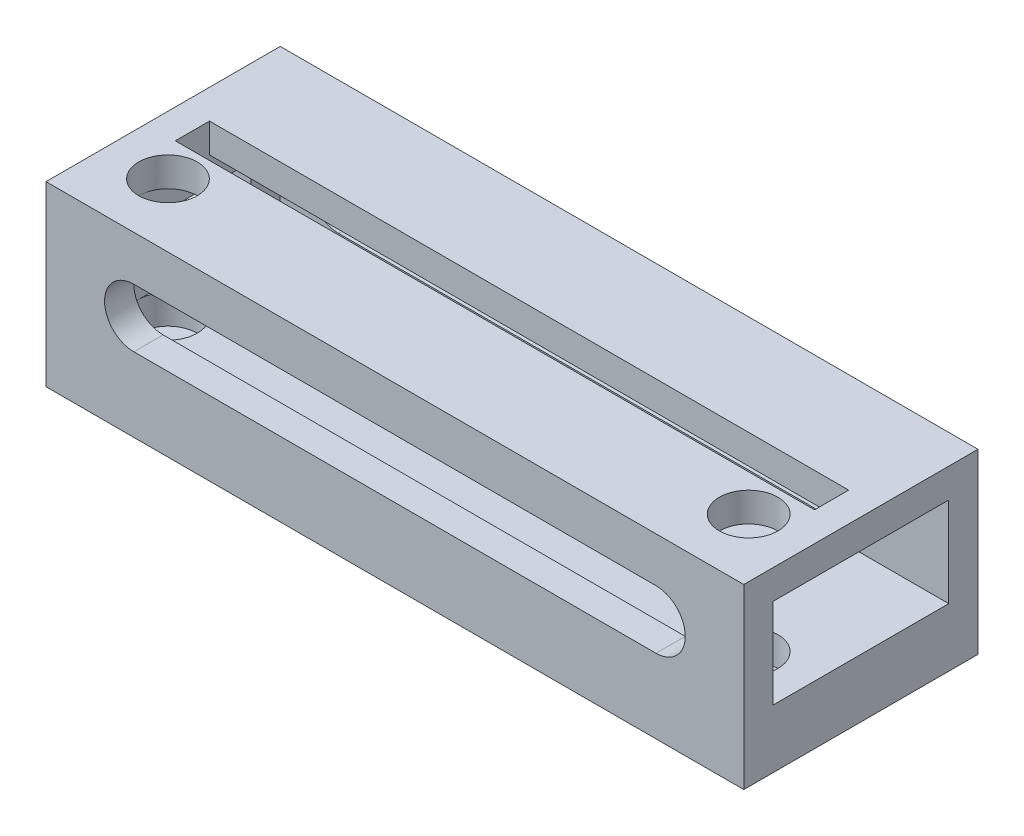
ISO-10303-21;
HEADER;
FILE_DESCRIPTION(('STEP AP214'),'2;1');
FILE_NAME('part.step','',(''),(''),'','','');
FILE_SCHEMA(('AUTOMOTIVE_DESIGN { 1 0 10303 214 1 1 1 1 }'));
ENDSEC;
DATA;
#1=APPLICATION_CONTEXT('core data for automotive mechanical design processes');
#2=APPLICATION_PROTOCOL_DEFINITION('international standard','automotive_design',2000,#1);
#3=PRODUCT_CONTEXT('',#1,'mechanical');
#4=PRODUCT('Part','Part','',(#3));
#5=PRODUCT_RELATED_PRODUCT_CATEGORY('part','',(#4));
#6=PRODUCT_DEFINITION_FORMATION('','',#4);
#7=PRODUCT_DEFINITION_CONTEXT('part definition',#1,'design');
#8=PRODUCT_DEFINITION('design','',#6,#7);
#9=PRODUCT_DEFINITION_SHAPE('','',#8);
#10=(LENGTH_UNIT() NAMED_UNIT(*) SI_UNIT(.MILLI.,.METRE.));
#11=(NAMED_UNIT(*) PLANE_ANGLE_UNIT() SI_UNIT($,.RADIAN.));
#12=(NAMED_UNIT(*) SI_UNIT($,.STERADIAN.) SOLID_ANGLE_UNIT());
#13=UNCERTAINTY_MEASURE_WITH_UNIT(LENGTH_MEASURE(1.E-05),#10,'distance_accuracy_value','');
#14=(GEOMETRIC_REPRESENTATION_CONTEXT(3) GLOBAL_UNCERTAINTY_ASSIGNED_CONTEXT((#13)) GLOBAL_UNIT_ASSIGNED_CONTEXT((#10,
#11,#12)) REPRESENTATION_CONTEXT('',''));
#15=CARTESIAN_POINT('',(0.,0.,0.));
#16=DIRECTION('',(0.,0.,1.));
#17=DIRECTION('',(1.,0.,0.));
#18=AXIS2_PLACEMENT_3D('',#15,#16,#17);
#19=CARTESIAN_POINT('',(0.,0.,0.));
#20=DIRECTION('',(0.,-1.,0.));
#21=DIRECTION('',(0.,0.,-1.));
#22=AXIS2_PLACEMENT_3D('',#19,#20,#21);
#23=PLANE('',#22);
#24=DIRECTION('',(0.,0.,-1.));
#25=VECTOR('',#24,1.);
#26=CARTESIAN_POINT('',(35.75,0.,-17.5));
#27=LINE('',#26,#25);
#28=CARTESIAN_POINT('',(35.75,0.,6.5));
#29=VERTEX_POINT('',#28);
#30=CARTESIAN_POINT('',(35.75,0.,-17.5));
#31=VERTEX_POINT('',#30);
#32=EDGE_CURVE('E201',#29,#31,#27,.T.);
#33=ORIENTED_EDGE('',*,*,#32,.T.);
#34=DIRECTION('',(-1.,0.,0.));
#35=VECTOR('',#34,1.);
#36=CARTESIAN_POINT('',(32.75,0.,-17.5));
#37=LINE('',#36,#35);
#38=CARTESIAN_POINT('',(107.25,0.,-17.5));
#39=VERTEX_POINT('',#38);
#40=EDGE_CURVE('E45',#39,#31,#37,.T.);
#41=ORIENTED_EDGE('',*,*,#40,.F.);
#42=DIRECTION('',(0.,0.,1.));
#43=VECTOR('',#42,1.);
#44=CARTESIAN_POINT('',(107.25,0.,6.5));
#45=LINE('',#44,#43);
#46=CARTESIAN_POINT('',(107.25,0.,6.5));
#47=VERTEX_POINT('',#46);
#48=EDGE_CURVE('E221',#39,#47,#45,.T.);
#49=ORIENTED_EDGE('',*,*,#48,.T.);
#50=DIRECTION('',(1.,0.,0.));
#51=VECTOR('',#50,1.);
#52=CARTESIAN_POINT('',(-32.75,0.,6.5));
#53=LINE('',#52,#51);
#54=EDGE_CURVE('E13',#29,#47,#53,.T.);
#55=ORIENTED_EDGE('',*,*,#54,.F.);
#56=EDGE_LOOP('',(#33,#41,#49,#55));
#57=FACE_BOUND('',#56,.T.);
#58=CARTESIAN_POINT('',(101.25,0.,0.));
#59=DIRECTION('',(0.,-1.,0.));
#60=DIRECTION('',(0.,0.,1.));
#61=AXIS2_PLACEMENT_3D('',#58,#59,#60);
#62=CIRCLE('',#61,0.99839537848789);
#63=CARTESIAN_POINT('',(101.25,0.,0.99839537848789));
#64=VERTEX_POINT('',#63);
#65=EDGE_CURVE('E245',#64,#64,#62,.T.);
#66=ORIENTED_EDGE('',*,*,#65,.F.);
#67=EDGE_LOOP('',(#66));
#68=FACE_BOUND('',#67,.T.);
#69=CARTESIAN_POINT('',(41.75,0.,0.));
#70=DIRECTION('',(0.,-1.,0.));
#71=DIRECTION('',(0.,0.,1.));
#72=AXIS2_PLACEMENT_3D('',#69,#70,#71);
#73=CIRCLE('',#72,1.24311598076932);
#74=CARTESIAN_POINT('',(41.75,0.,1.24311598076932));
#75=VERTEX_POINT('',#74);
#76=EDGE_CURVE('E242',#75,#75,#73,.T.);
#77=ORIENTED_EDGE('',*,*,#76,.F.);
#78=EDGE_LOOP('',(#77));
#79=FACE_BOUND('',#78,.T.);
#80=ADVANCED_FACE('F38',(#57,#68,#79),#23,.T.);
#81=CARTESIAN_POINT('',(0.,0.,6.5));
#82=DIRECTION('',(0.,0.,1.));
#83=DIRECTION('',(1.,0.,0.));
#84=AXIS2_PLACEMENT_3D('',#81,#82,#83);
#85=PLANE('',#84);
#86=DIRECTION('',(0.,1.,0.));
#87=VECTOR('',#86,1.);
#88=CARTESIAN_POINT('',(35.75,0.,6.5));
#89=LINE('',#88,#87);
#90=CARTESIAN_POINT('',(35.75,18.2,6.5));
#91=VERTEX_POINT('',#90);
#92=EDGE_CURVE('E60',#29,#91,#89,.T.);
#93=ORIENTED_EDGE('',*,*,#92,.F.);
#94=ORIENTED_EDGE('',*,*,#54,.T.);
#95=DIRECTION('',(0.,1.,0.));
#96=VECTOR('',#95,1.);
#97=CARTESIAN_POINT('',(107.25,15.2,6.5));
#98=LINE('',#97,#96);
#99=CARTESIAN_POINT('',(107.25,18.2,6.5));
#100=VERTEX_POINT('',#99);
#101=EDGE_CURVE('E226',#47,#100,#98,.T.);
#102=ORIENTED_EDGE('',*,*,#101,.T.);
#103=DIRECTION('',(1.,0.,0.));
#104=VECTOR('',#103,1.);
#105=CARTESIAN_POINT('',(-35.75,18.2,6.5));
#106=LINE('',#105,#104);
#107=EDGE_CURVE('E216',#91,#100,#106,.T.);
#108=ORIENTED_EDGE('',*,*,#107,.F.);
#109=EDGE_LOOP('',(#93,#94,#102,#108));
#110=FACE_BOUND('',#109,.T.);
#111=CARTESIAN_POINT('',(98.25,10.6,6.5));
#112=DIRECTION('',(0.,0.,-1.));
#113=DIRECTION('',(-1.,0.,0.));
#114=AXIS2_PLACEMENT_3D('',#111,#112,#113);
#115=CIRCLE('',#114,3.);
#116=CARTESIAN_POINT('',(98.25,13.6,6.5));
#117=VERTEX_POINT('',#116);
#118=CARTESIAN_POINT('',(98.25,7.6,6.5));
#119=VERTEX_POINT('',#118);
#120=EDGE_CURVE('E357',#117,#119,#115,.T.);
#121=ORIENTED_EDGE('',*,*,#120,.T.);
#122=DIRECTION('',(1.,0.,0.));
#123=VECTOR('',#122,1.);
#124=CARTESIAN_POINT('',(71.5,7.6,6.5));
#125=LINE('',#124,#123);
#126=CARTESIAN_POINT('',(44.75,7.6,6.5));
#127=VERTEX_POINT('',#126);
#128=EDGE_CURVE('E354',#127,#119,#125,.T.);
#129=ORIENTED_EDGE('',*,*,#128,.F.);
#130=CARTESIAN_POINT('',(44.75,10.6,6.5));
#131=DIRECTION('',(0.,0.,-1.));
#132=DIRECTION('',(-1.,0.,0.));
#133=AXIS2_PLACEMENT_3D('',#130,#131,#132);
#134=CIRCLE('',#133,3.);
#135=CARTESIAN_POINT('',(44.75,13.6,6.5));
#136=VERTEX_POINT('',#135);
#137=EDGE_CURVE('E351',#127,#136,#134,.T.);
#138=ORIENTED_EDGE('',*,*,#137,.T.);
#139=DIRECTION('',(-1.,0.,0.));
#140=VECTOR('',#139,1.);
#141=CARTESIAN_POINT('',(71.5,13.6,6.5));
#142=LINE('',#141,#140);
#143=EDGE_CURVE('E347',#117,#136,#142,.T.);
#144=ORIENTED_EDGE('',*,*,#143,.F.);
#145=EDGE_LOOP('',(#121,#129,#138,#144));
#146=FACE_BOUND('',#145,.T.);
#147=ADVANCED_FACE('F212',(#110,#146),#85,.T.);
#148=CARTESIAN_POINT('',(0.,0.,-17.5));
#149=DIRECTION('',(0.,0.,-1.));
#150=DIRECTION('',(-1.,0.,0.));
#151=AXIS2_PLACEMENT_3D('',#148,#149,#150);
#152=PLANE('',#151);
#153=DIRECTION('',(0.,1.,0.));
#154=VECTOR('',#153,1.);
#155=CARTESIAN_POINT('',(35.75,0.,-17.5));
#156=LINE('',#155,#154);
#157=CARTESIAN_POINT('',(35.75,18.2,-17.5));
#158=VERTEX_POINT('',#157);
#159=EDGE_CURVE('E204',#31,#158,#156,.T.);
#160=ORIENTED_EDGE('',*,*,#159,.T.);
#161=DIRECTION('',(-1.,0.,0.));
#162=VECTOR('',#161,1.);
#163=CARTESIAN_POINT('',(-35.75,18.2,-17.5));
#164=LINE('',#163,#162);
#165=CARTESIAN_POINT('',(107.25,18.2,-17.5));
#166=VERTEX_POINT('',#165);
#167=EDGE_CURVE('E261',#166,#158,#164,.T.);
#168=ORIENTED_EDGE('',*,*,#167,.F.);
#169=DIRECTION('',(0.,1.,0.));
#170=VECTOR('',#169,1.);
#171=CARTESIAN_POINT('',(107.25,15.2,-17.5));
#172=LINE('',#171,#170);
#173=EDGE_CURVE('E231',#39,#166,#172,.T.);
#174=ORIENTED_EDGE('',*,*,#173,.F.);
#175=ORIENTED_EDGE('',*,*,#40,.T.);
#176=EDGE_LOOP('',(#160,#168,#174,#175));
#177=FACE_BOUND('',#176,.T.);
#178=CARTESIAN_POINT('',(98.25,10.6,-17.5));
#179=DIRECTION('',(0.,0.,-1.));
#180=DIRECTION('',(-1.,0.,0.));
#181=AXIS2_PLACEMENT_3D('',#178,#179,#180);
#182=CIRCLE('',#181,3.);
#183=CARTESIAN_POINT('',(98.25,13.6,-17.5));
#184=VERTEX_POINT('',#183);
#185=CARTESIAN_POINT('',(98.25,7.6,-17.5));
#186=VERTEX_POINT('',#185);
#187=EDGE_CURVE('E350',#184,#186,#182,.T.);
#188=ORIENTED_EDGE('',*,*,#187,.F.);
#189=DIRECTION('',(-1.,0.,0.));
#190=VECTOR('',#189,1.);
#191=CARTESIAN_POINT('',(71.5,13.6,-17.5));
#192=LINE('',#191,#190);
#193=CARTESIAN_POINT('',(44.75,13.6,-17.5));
#194=VERTEX_POINT('',#193);
#195=EDGE_CURVE('E361',#184,#194,#192,.T.);
#196=ORIENTED_EDGE('',*,*,#195,.T.);
#197=CARTESIAN_POINT('',(44.75,10.6,-17.5));
#198=DIRECTION('',(0.,0.,-1.));
#199=DIRECTION('',(-1.,0.,0.));
#200=AXIS2_PLACEMENT_3D('',#197,#198,#199);
#201=CIRCLE('',#200,3.);
#202=CARTESIAN_POINT('',(44.75,7.6,-17.5));
#203=VERTEX_POINT('',#202);
#204=EDGE_CURVE('E364',#203,#194,#201,.T.);
#205=ORIENTED_EDGE('',*,*,#204,.F.);
#206=DIRECTION('',(1.,0.,0.));
#207=VECTOR('',#206,1.);
#208=CARTESIAN_POINT('',(71.5,7.6,-17.5));
#209=LINE('',#208,#207);
#210=EDGE_CURVE('E367',#203,#186,#209,.T.);
#211=ORIENTED_EDGE('',*,*,#210,.T.);
#212=EDGE_LOOP('',(#188,#196,#205,#211));
#213=FACE_BOUND('',#212,.T.);
#214=ADVANCED_FACE('F276',(#177,#213),#152,.T.);
#215=CARTESIAN_POINT('',(35.75,12.45,0.));
#216=DIRECTION('',(0.,1.,0.));
#217=DIRECTION('',(0.,0.,1.));
#218=AXIS2_PLACEMENT_3D('',#215,#216,#217);
#219=PLANE('',#218);
#220=DIRECTION('',(-1.,0.,0.));
#221=VECTOR('',#220,1.);
#222=CARTESIAN_POINT('',(35.75,12.45,0.499999999999997));
#223=LINE('',#222,#221);
#224=CARTESIAN_POINT('',(38.75,12.45,0.499999999999997));
#225=VERTEX_POINT('',#224);
#226=CARTESIAN_POINT('',(35.75,12.45,0.499999999999997));
#227=VERTEX_POINT('',#226);
#228=EDGE_CURVE('E264',#225,#227,#223,.T.);
#229=ORIENTED_EDGE('',*,*,#228,.T.);
#230=DIRECTION('',(0.,0.,-1.));
#231=VECTOR('',#230,1.);
#232=CARTESIAN_POINT('',(35.75,12.45,0.));
#233=LINE('',#232,#231);
#234=CARTESIAN_POINT('',(35.75,12.45,-11.5));
#235=VERTEX_POINT('',#234);
#236=EDGE_CURVE('E52',#227,#235,#233,.T.);
#237=ORIENTED_EDGE('',*,*,#236,.T.);
#238=DIRECTION('',(-1.,0.,0.));
#239=VECTOR('',#238,1.);
#240=CARTESIAN_POINT('',(35.75,12.45,-11.5));
#241=LINE('',#240,#239);
#242=CARTESIAN_POINT('',(38.75,12.45,-11.5));
#243=VERTEX_POINT('',#242);
#244=EDGE_CURVE('E273',#243,#235,#241,.T.);
#245=ORIENTED_EDGE('',*,*,#244,.F.);
#246=DIRECTION('',(0.,0.,-1.));
#247=VECTOR('',#246,1.);
#248=CARTESIAN_POINT('',(38.75,12.45,0.));
#249=LINE('',#248,#247);
#250=EDGE_CURVE('E301',#225,#243,#249,.T.);
#251=ORIENTED_EDGE('',*,*,#250,.F.);
#252=EDGE_LOOP('',(#229,#237,#245,#251));
#253=FACE_BOUND('',#252,.T.);
#254=ADVANCED_FACE('F506',(#253),#219,.F.);
#255=CARTESIAN_POINT('',(35.75,0.,-11.5));
#256=DIRECTION('',(0.,0.,-1.));
#257=DIRECTION('',(-1.,0.,0.));
#258=AXIS2_PLACEMENT_3D('',#255,#256,#257);
#259=PLANE('',#258);
#260=ORIENTED_EDGE('',*,*,#244,.T.);
#261=DIRECTION('',(0.,-1.,0.));
#262=VECTOR('',#261,1.);
#263=CARTESIAN_POINT('',(35.75,0.,-11.5));
#264=LINE('',#263,#262);
#265=CARTESIAN_POINT('',(35.75,8.75,-11.5));
#266=VERTEX_POINT('',#265);
#267=EDGE_CURVE('E433',#235,#266,#264,.T.);
#268=ORIENTED_EDGE('',*,*,#267,.T.);
#269=DIRECTION('',(-1.,0.,0.));
#270=VECTOR('',#269,1.);
#271=CARTESIAN_POINT('',(35.75,8.75,-11.5));
#272=LINE('',#271,#270);
#273=CARTESIAN_POINT('',(38.75,8.75,-11.5));
#274=VERTEX_POINT('',#273);
#275=EDGE_CURVE('E270',#274,#266,#272,.T.);
#276=ORIENTED_EDGE('',*,*,#275,.F.);
#277=DIRECTION('',(0.,-1.,0.));
#278=VECTOR('',#277,1.);
#279=CARTESIAN_POINT('',(38.75,0.,-11.5));
#280=LINE('',#279,#278);
#281=EDGE_CURVE('E297',#243,#274,#280,.T.);
#282=ORIENTED_EDGE('',*,*,#281,.F.);
#283=EDGE_LOOP('',(#260,#268,#276,#282));
#284=FACE_BOUND('',#283,.T.);
#285=ADVANCED_FACE('F511',(#284),#259,.F.);
#286=CARTESIAN_POINT('',(35.75,8.75,0.));
#287=DIRECTION('',(0.,-1.,0.));
#288=DIRECTION('',(0.,0.,-1.));
#289=AXIS2_PLACEMENT_3D('',#286,#287,#288);
#290=PLANE('',#289);
#291=ORIENTED_EDGE('',*,*,#275,.T.);
#292=DIRECTION('',(0.,0.,1.));
#293=VECTOR('',#292,1.);
#294=CARTESIAN_POINT('',(35.75,8.75,0.));
#295=LINE('',#294,#293);
#296=CARTESIAN_POINT('',(35.75,8.75,0.499999999999997));
#297=VERTEX_POINT('',#296);
#298=EDGE_CURVE('E436',#266,#297,#295,.T.);
#299=ORIENTED_EDGE('',*,*,#298,.T.);
#300=DIRECTION('',(-1.,0.,0.));
#301=VECTOR('',#300,1.);
#302=CARTESIAN_POINT('',(35.75,8.75,0.499999999999997));
#303=LINE('',#302,#301);
#304=CARTESIAN_POINT('',(38.75,8.75,0.499999999999997));
#305=VERTEX_POINT('',#304);
#306=EDGE_CURVE('E267',#305,#297,#303,.T.);
#307=ORIENTED_EDGE('',*,*,#306,.F.);
#308=DIRECTION('',(0.,0.,1.));
#309=VECTOR('',#308,1.);
#310=CARTESIAN_POINT('',(38.75,8.75,0.));
#311=LINE('',#310,#309);
#312=EDGE_CURVE('E293',#274,#305,#311,.T.);
#313=ORIENTED_EDGE('',*,*,#312,.F.);
#314=EDGE_LOOP('',(#291,#299,#307,#313));
#315=FACE_BOUND('',#314,.T.);
#316=ADVANCED_FACE('F515',(#315),#290,.F.);
#317=CARTESIAN_POINT('',(35.75,0.,0.499999999999996));
#318=DIRECTION('',(0.,0.,-1.));
#319=DIRECTION('',(0.,1.,0.));
#320=AXIS2_PLACEMENT_3D('',#317,#318,#319);
#321=PLANE('',#320);
#322=DIRECTION('',(0.,-1.,0.));
#323=VECTOR('',#322,1.);
#324=CARTESIAN_POINT('',(35.75,0.,0.499999999999996));
#325=LINE('',#324,#323);
#326=EDGE_CURVE('E439',#227,#297,#325,.T.);
#327=ORIENTED_EDGE('',*,*,#326,.F.);
#328=ORIENTED_EDGE('',*,*,#228,.F.);
#329=DIRECTION('',(0.,-1.,0.));
#330=VECTOR('',#329,1.);
#331=CARTESIAN_POINT('',(38.75,0.,0.499999999999996));
#332=LINE('',#331,#330);
#333=EDGE_CURVE('E286',#225,#305,#332,.T.);
#334=ORIENTED_EDGE('',*,*,#333,.T.);
#335=ORIENTED_EDGE('',*,*,#306,.T.);
#336=EDGE_LOOP('',(#327,#328,#334,#335));
#337=FACE_BOUND('',#336,.T.);
#338=ADVANCED_FACE('F519',(#337),#321,.T.);
#339=CARTESIAN_POINT('',(0.,18.2,0.));
#340=DIRECTION('',(0.,1.,0.));
#341=DIRECTION('',(0.,0.,1.));
#342=AXIS2_PLACEMENT_3D('',#339,#340,#341);
#343=PLANE('',#342);
#344=DIRECTION('',(0.,0.,-1.));
#345=VECTOR('',#344,1.);
#346=CARTESIAN_POINT('',(35.75,18.2,-17.5));
#347=LINE('',#346,#345);
#348=EDGE_CURVE('E208',#91,#158,#347,.T.);
#349=ORIENTED_EDGE('',*,*,#348,.F.);
#350=ORIENTED_EDGE('',*,*,#107,.T.);
#351=DIRECTION('',(0.,0.,1.));
#352=VECTOR('',#351,1.);
#353=CARTESIAN_POINT('',(107.25,18.2,-17.5));
#354=LINE('',#353,#352);
#355=EDGE_CURVE('E379',#166,#100,#354,.T.);
#356=ORIENTED_EDGE('',*,*,#355,.F.);
#357=ORIENTED_EDGE('',*,*,#167,.T.);
#358=EDGE_LOOP('',(#349,#350,#356,#357));
#359=FACE_BOUND('',#358,.T.);
#360=CARTESIAN_POINT('',(101.25,18.2,0.));
#361=DIRECTION('',(0.,-1.,0.));
#362=DIRECTION('',(0.,0.,1.));
#363=AXIS2_PLACEMENT_3D('',#360,#361,#362);
#364=CIRCLE('',#363,3.);
#365=CARTESIAN_POINT('',(101.25,18.2,3.));
#366=VERTEX_POINT('',#365);
#367=EDGE_CURVE('E424',#366,#366,#364,.T.);
#368=ORIENTED_EDGE('',*,*,#367,.T.);
#369=EDGE_LOOP('',(#368));
#370=FACE_BOUND('',#369,.T.);
#371=CARTESIAN_POINT('',(41.75,18.2,0.));
#372=DIRECTION('',(0.,-1.,0.));
#373=DIRECTION('',(0.,0.,1.));
#374=AXIS2_PLACEMENT_3D('',#371,#372,#373);
#375=CIRCLE('',#374,3.);
#376=CARTESIAN_POINT('',(41.75,18.2,3.));
#377=VERTEX_POINT('',#376);
#378=EDGE_CURVE('E425',#377,#377,#375,.T.);
#379=ORIENTED_EDGE('',*,*,#378,.T.);
#380=EDGE_LOOP('',(#379));
#381=FACE_BOUND('',#380,.T.);
#382=DIRECTION('',(0.,0.,1.));
#383=VECTOR('',#382,1.);
#384=CARTESIAN_POINT('',(104.25,18.2,-7.25));
#385=LINE('',#384,#383);
#386=CARTESIAN_POINT('',(104.25,18.2,-7.25));
#387=VERTEX_POINT('',#386);
#388=CARTESIAN_POINT('',(104.25,18.2,-3.75));
#389=VERTEX_POINT('',#388);
#390=EDGE_CURVE('E259',#387,#389,#385,.T.);
#391=ORIENTED_EDGE('',*,*,#390,.T.);
#392=DIRECTION('',(-1.,0.,0.));
#393=VECTOR('',#392,1.);
#394=CARTESIAN_POINT('',(104.25,18.2,-3.75));
#395=LINE('',#394,#393);
#396=CARTESIAN_POINT('',(38.75,18.2,-3.75));
#397=VERTEX_POINT('',#396);
#398=EDGE_CURVE('E401',#389,#397,#395,.T.);
#399=ORIENTED_EDGE('',*,*,#398,.T.);
#400=DIRECTION('',(0.,0.,-1.));
#401=VECTOR('',#400,1.);
#402=CARTESIAN_POINT('',(38.75,18.2,-7.25));
#403=LINE('',#402,#401);
#404=CARTESIAN_POINT('',(38.75,18.2,-7.25));
#405=VERTEX_POINT('',#404);
#406=EDGE_CURVE('E398',#397,#405,#403,.T.);
#407=ORIENTED_EDGE('',*,*,#406,.T.);
#408=DIRECTION('',(1.,0.,0.));
#409=VECTOR('',#408,1.);
#410=CARTESIAN_POINT('',(104.25,18.2,-7.25));
#411=LINE('',#410,#409);
#412=EDGE_CURVE('E394',#405,#387,#411,.T.);
#413=ORIENTED_EDGE('',*,*,#412,.T.);
#414=EDGE_LOOP('',(#391,#399,#407,#413));
#415=FACE_BOUND('',#414,.T.);
#416=ADVANCED_FACE('F443',(#359,#370,#381,#415),#343,.T.);
#417=CARTESIAN_POINT('',(71.5,6.,0.));
#418=DIRECTION('',(0.,-1.,0.));
#419=DIRECTION('',(0.,0.,-1.));
#420=AXIS2_PLACEMENT_3D('',#417,#418,#419);
#421=PLANE('',#420);
#422=CARTESIAN_POINT('',(101.25,6.,0.));
#423=DIRECTION('',(0.,1.,0.));
#424=DIRECTION('',(0.,0.,-1.));
#425=AXIS2_PLACEMENT_3D('',#422,#423,#424);
#426=CIRCLE('',#425,3.);
#427=CARTESIAN_POINT('',(101.25,6.,3.));
#428=VERTEX_POINT('',#427);
#429=EDGE_CURVE('E256',#428,#428,#426,.T.);
#430=ORIENTED_EDGE('',*,*,#429,.F.);
#431=EDGE_LOOP('',(#430));
#432=FACE_BOUND('',#431,.T.);
#433=DIRECTION('',(0.,0.,-1.));
#434=VECTOR('',#433,1.);
#435=CARTESIAN_POINT('',(38.75,6.,4.5));
#436=LINE('',#435,#434);
#437=CARTESIAN_POINT('',(38.75,6.,3.5));
#438=VERTEX_POINT('',#437);
#439=CARTESIAN_POINT('',(38.75,6.,0.));
#440=VERTEX_POINT('',#439);
#441=EDGE_CURVE('E249',#438,#440,#436,.T.);
#442=ORIENTED_EDGE('',*,*,#441,.F.);
#443=DIRECTION('',(1.,0.,0.));
#444=VECTOR('',#443,1.);
#445=CARTESIAN_POINT('',(38.75,6.,3.5));
#446=LINE('',#445,#444);
#447=CARTESIAN_POINT('',(107.25,6.,3.5));
#448=VERTEX_POINT('',#447);
#449=EDGE_CURVE('E225',#438,#448,#446,.T.);
#450=ORIENTED_EDGE('',*,*,#449,.T.);
#451=DIRECTION('',(0.,0.,1.));
#452=VECTOR('',#451,1.);
#453=CARTESIAN_POINT('',(107.25,6.,-14.5));
#454=LINE('',#453,#452);
#455=CARTESIAN_POINT('',(107.25,6.,-14.5));
#456=VERTEX_POINT('',#455);
#457=EDGE_CURVE('E374',#456,#448,#454,.T.);
#458=ORIENTED_EDGE('',*,*,#457,.F.);
#459=DIRECTION('',(-1.,0.,0.));
#460=VECTOR('',#459,1.);
#461=CARTESIAN_POINT('',(38.75,6.,-14.5));
#462=LINE('',#461,#460);
#463=CARTESIAN_POINT('',(38.75,6.,-14.5));
#464=VERTEX_POINT('',#463);
#465=EDGE_CURVE('E239',#456,#464,#462,.T.);
#466=ORIENTED_EDGE('',*,*,#465,.T.);
#467=EDGE_CURVE('E248',#440,#464,#436,.T.);
#468=ORIENTED_EDGE('',*,*,#467,.F.);
#469=CARTESIAN_POINT('',(41.75,6.,0.));
#470=DIRECTION('',(0.,1.,0.));
#471=DIRECTION('',(0.,0.,-1.));
#472=AXIS2_PLACEMENT_3D('',#469,#470,#471);
#473=CIRCLE('',#472,3.);
#474=EDGE_CURVE('E416',#440,#440,#473,.T.);
#475=ORIENTED_EDGE('',*,*,#474,.F.);
#476=EDGE_LOOP('',(#442,#450,#458,#466,#468,#475));
#477=FACE_BOUND('',#476,.T.);
#478=ADVANCED_FACE('F457',(#432,#477),#421,.F.);
#479=CARTESIAN_POINT('',(101.25,6.,0.));
#480=DIRECTION('',(0.,-1.,0.));
#481=DIRECTION('',(0.,0.,-1.));
#482=AXIS2_PLACEMENT_3D('',#479,#480,#481);
#483=CYLINDRICAL_SURFACE('',#482,0.99839537848789);
#484=CARTESIAN_POINT('',(101.25,3.,0.));
#485=DIRECTION('',(0.,1.,0.));
#486=DIRECTION('',(0.,0.,-1.));
#487=AXIS2_PLACEMENT_3D('',#484,#485,#486);
#488=CIRCLE('',#487,0.99839537848789);
#489=CARTESIAN_POINT('',(101.25,3.,-0.99839537848789));
#490=VERTEX_POINT('',#489);
#491=EDGE_CURVE('E255',#490,#490,#488,.T.);
#492=ORIENTED_EDGE('',*,*,#491,.T.);
#493=EDGE_LOOP('',(#492));
#494=FACE_BOUND('',#493,.T.);
#495=ORIENTED_EDGE('',*,*,#65,.T.);
#496=EDGE_LOOP('',(#495));
#497=FACE_BOUND('',#496,.T.);
#498=ADVANCED_FACE('F527',(#494,#497),#483,.F.);
#499=CARTESIAN_POINT('',(41.75,6.,0.));
#500=DIRECTION('',(0.,-1.,0.));
#501=DIRECTION('',(0.,0.,-1.));
#502=AXIS2_PLACEMENT_3D('',#499,#500,#501);
#503=CYLINDRICAL_SURFACE('',#502,1.24311598076932);
#504=CARTESIAN_POINT('',(41.75,3.,0.));
#505=DIRECTION('',(0.,1.,0.));
#506=DIRECTION('',(0.,0.,-1.));
#507=AXIS2_PLACEMENT_3D('',#504,#505,#506);
#508=CIRCLE('',#507,1.24311598076932);
#509=CARTESIAN_POINT('',(41.75,3.,-1.24311598076932));
#510=VERTEX_POINT('',#509);
#511=EDGE_CURVE('E252',#510,#510,#508,.T.);
#512=ORIENTED_EDGE('',*,*,#511,.T.);
#513=EDGE_LOOP('',(#512));
#514=FACE_BOUND('',#513,.T.);
#515=ORIENTED_EDGE('',*,*,#76,.T.);
#516=EDGE_LOOP('',(#515));
#517=FACE_BOUND('',#516,.T.);
#518=ADVANCED_FACE('F531',(#514,#517),#503,.F.);
#519=CARTESIAN_POINT('',(38.75,15.2,3.5));
#520=DIRECTION('',(0.,0.,1.));
#521=DIRECTION('',(-1.,0.,0.));
#522=AXIS2_PLACEMENT_3D('',#519,#520,#521);
#523=PLANE('',#522);
#524=DIRECTION('',(-1.,0.,0.));
#525=VECTOR('',#524,1.);
#526=CARTESIAN_POINT('',(38.75,13.6,3.5));
#527=LINE('',#526,#525);
#528=CARTESIAN_POINT('',(98.25,13.6,3.5));
#529=VERTEX_POINT('',#528);
#530=CARTESIAN_POINT('',(44.75,13.6,3.5));
#531=VERTEX_POINT('',#530);
#532=EDGE_CURVE('E317',#529,#531,#527,.T.);
#533=ORIENTED_EDGE('',*,*,#532,.T.);
#534=CARTESIAN_POINT('',(44.75,10.6,3.5));
#535=DIRECTION('',(0.,0.,-1.));
#536=DIRECTION('',(-1.,0.,0.));
#537=AXIS2_PLACEMENT_3D('',#534,#535,#536);
#538=CIRCLE('',#537,3.);
#539=CARTESIAN_POINT('',(44.75,7.6,3.5));
#540=VERTEX_POINT('',#539);
#541=EDGE_CURVE('E323',#540,#531,#538,.T.);
#542=ORIENTED_EDGE('',*,*,#541,.F.);
#543=DIRECTION('',(1.,0.,0.));
#544=VECTOR('',#543,1.);
#545=CARTESIAN_POINT('',(38.75,7.6,3.5));
#546=LINE('',#545,#544);
#547=CARTESIAN_POINT('',(98.25,7.6,3.5));
#548=VERTEX_POINT('',#547);
#549=EDGE_CURVE('E329',#540,#548,#546,.T.);
#550=ORIENTED_EDGE('',*,*,#549,.T.);
#551=CARTESIAN_POINT('',(98.25,10.6,3.5));
#552=DIRECTION('',(0.,0.,-1.));
#553=DIRECTION('',(-1.,0.,0.));
#554=AXIS2_PLACEMENT_3D('',#551,#552,#553);
#555=CIRCLE('',#554,3.);
#556=EDGE_CURVE('E311',#529,#548,#555,.T.);
#557=ORIENTED_EDGE('',*,*,#556,.F.);
#558=EDGE_LOOP('',(#533,#542,#550,#557));
#559=FACE_BOUND('',#558,.T.);
#560=ORIENTED_EDGE('',*,*,#449,.F.);
#561=DIRECTION('',(0.,-1.,0.));
#562=VECTOR('',#561,1.);
#563=CARTESIAN_POINT('',(38.75,15.2,3.5));
#564=LINE('',#563,#562);
#565=CARTESIAN_POINT('',(38.75,15.2,3.5));
#566=VERTEX_POINT('',#565);
#567=EDGE_CURVE('E236',#566,#438,#564,.T.);
#568=ORIENTED_EDGE('',*,*,#567,.F.);
#569=DIRECTION('',(1.,0.,0.));
#570=VECTOR('',#569,1.);
#571=CARTESIAN_POINT('',(38.75,15.2,3.5));
#572=LINE('',#571,#570);
#573=CARTESIAN_POINT('',(107.25,15.2,3.5));
#574=VERTEX_POINT('',#573);
#575=EDGE_CURVE('E229',#566,#574,#572,.T.);
#576=ORIENTED_EDGE('',*,*,#575,.T.);
#577=DIRECTION('',(0.,1.,0.));
#578=VECTOR('',#577,1.);
#579=CARTESIAN_POINT('',(107.25,15.2,3.5));
#580=LINE('',#579,#578);
#581=EDGE_CURVE('E360',#448,#574,#580,.T.);
#582=ORIENTED_EDGE('',*,*,#581,.F.);
#583=EDGE_LOOP('',(#560,#568,#576,#582));
#584=FACE_BOUND('',#583,.T.);
#585=ADVANCED_FACE('F449',(#559,#584),#523,.F.);
#586=CARTESIAN_POINT('',(107.25,0.,0.));
#587=DIRECTION('',(-1.,0.,0.));
#588=DIRECTION('',(0.,0.,-1.));
#589=AXIS2_PLACEMENT_3D('',#586,#587,#588);
#590=PLANE('',#589);
#591=ORIENTED_EDGE('',*,*,#355,.T.);
#592=ORIENTED_EDGE('',*,*,#101,.F.);
#593=ORIENTED_EDGE('',*,*,#48,.F.);
#594=ORIENTED_EDGE('',*,*,#173,.T.);
#595=EDGE_LOOP('',(#591,#592,#593,#594));
#596=FACE_BOUND('',#595,.T.);
#597=ORIENTED_EDGE('',*,*,#457,.T.);
#598=ORIENTED_EDGE('',*,*,#581,.T.);
#599=DIRECTION('',(0.,0.,1.));
#600=VECTOR('',#599,1.);
#601=CARTESIAN_POINT('',(107.25,15.2,-17.5));
#602=LINE('',#601,#600);
#603=CARTESIAN_POINT('',(107.25,15.2,-14.5));
#604=VERTEX_POINT('',#603);
#605=EDGE_CURVE('E380',#604,#574,#602,.T.);
#606=ORIENTED_EDGE('',*,*,#605,.F.);
#607=DIRECTION('',(0.,-1.,0.));
#608=VECTOR('',#607,1.);
#609=CARTESIAN_POINT('',(107.25,15.2,-14.5));
#610=LINE('',#609,#608);
#611=EDGE_CURVE('E377',#604,#456,#610,.T.);
#612=ORIENTED_EDGE('',*,*,#611,.T.);
#613=EDGE_LOOP('',(#597,#598,#606,#612));
#614=FACE_BOUND('',#613,.T.);
#615=ADVANCED_FACE('F445',(#596,#614),#590,.F.);
#616=CARTESIAN_POINT('',(71.5,0.,-14.5));
#617=DIRECTION('',(0.,0.,-1.));
#618=DIRECTION('',(1.,0.,0.));
#619=AXIS2_PLACEMENT_3D('',#616,#617,#618);
#620=PLANE('',#619);
#621=DIRECTION('',(-1.,0.,0.));
#622=VECTOR('',#621,1.);
#623=CARTESIAN_POINT('',(71.5,7.6,-14.5));
#624=LINE('',#623,#622);
#625=CARTESIAN_POINT('',(98.25,7.6,-14.5));
#626=VERTEX_POINT('',#625);
#627=CARTESIAN_POINT('',(44.75,7.6,-14.5));
#628=VERTEX_POINT('',#627);
#629=EDGE_CURVE('E332',#626,#628,#624,.T.);
#630=ORIENTED_EDGE('',*,*,#629,.T.);
#631=CARTESIAN_POINT('',(44.75,10.6,-14.5));
#632=DIRECTION('',(0.,0.,1.));
#633=DIRECTION('',(1.,0.,0.));
#634=AXIS2_PLACEMENT_3D('',#631,#632,#633);
#635=CIRCLE('',#634,3.);
#636=CARTESIAN_POINT('',(44.75,13.6,-14.5));
#637=VERTEX_POINT('',#636);
#638=EDGE_CURVE('E326',#637,#628,#635,.T.);
#639=ORIENTED_EDGE('',*,*,#638,.F.);
#640=DIRECTION('',(1.,0.,0.));
#641=VECTOR('',#640,1.);
#642=CARTESIAN_POINT('',(71.5,13.6,-14.5));
#643=LINE('',#642,#641);
#644=CARTESIAN_POINT('',(98.25,13.6,-14.5));
#645=VERTEX_POINT('',#644);
#646=EDGE_CURVE('E320',#637,#645,#643,.T.);
#647=ORIENTED_EDGE('',*,*,#646,.T.);
#648=CARTESIAN_POINT('',(98.25,10.6,-14.5));
#649=DIRECTION('',(0.,0.,1.));
#650=DIRECTION('',(1.,0.,0.));
#651=AXIS2_PLACEMENT_3D('',#648,#649,#650);
#652=CIRCLE('',#651,3.);
#653=EDGE_CURVE('E314',#626,#645,#652,.T.);
#654=ORIENTED_EDGE('',*,*,#653,.F.);
#655=EDGE_LOOP('',(#630,#639,#647,#654));
#656=FACE_BOUND('',#655,.T.);
#657=DIRECTION('',(-1.,0.,0.));
#658=VECTOR('',#657,1.);
#659=CARTESIAN_POINT('',(38.75,15.2,-14.5));
#660=LINE('',#659,#658);
#661=CARTESIAN_POINT('',(38.75,15.2,-14.5));
#662=VERTEX_POINT('',#661);
#663=EDGE_CURVE('E280',#604,#662,#660,.T.);
#664=ORIENTED_EDGE('',*,*,#663,.T.);
#665=DIRECTION('',(0.,-1.,0.));
#666=VECTOR('',#665,1.);
#667=CARTESIAN_POINT('',(38.75,15.2,-14.5));
#668=LINE('',#667,#666);
#669=EDGE_CURVE('E283',#662,#464,#668,.T.);
#670=ORIENTED_EDGE('',*,*,#669,.T.);
#671=ORIENTED_EDGE('',*,*,#465,.F.);
#672=ORIENTED_EDGE('',*,*,#611,.F.);
#673=EDGE_LOOP('',(#664,#670,#671,#672));
#674=FACE_BOUND('',#673,.T.);
#675=ADVANCED_FACE('F448',(#656,#674),#620,.F.);
#676=CARTESIAN_POINT('',(38.75,0.,0.));
#677=DIRECTION('',(-1.,0.,0.));
#678=DIRECTION('',(0.,0.,-1.));
#679=AXIS2_PLACEMENT_3D('',#676,#677,#678);
#680=PLANE('',#679);
#681=ORIENTED_EDGE('',*,*,#333,.F.);
#682=ORIENTED_EDGE('',*,*,#250,.T.);
#683=ORIENTED_EDGE('',*,*,#281,.T.);
#684=ORIENTED_EDGE('',*,*,#312,.T.);
#685=EDGE_LOOP('',(#681,#682,#683,#684));
#686=FACE_BOUND('',#685,.T.);
#687=ORIENTED_EDGE('',*,*,#467,.T.);
#688=ORIENTED_EDGE('',*,*,#669,.F.);
#689=DIRECTION('',(0.,0.,-1.));
#690=VECTOR('',#689,1.);
#691=CARTESIAN_POINT('',(38.75,15.2,0.));
#692=LINE('',#691,#690);
#693=CARTESIAN_POINT('',(38.75,15.2,-7.25));
#694=VERTEX_POINT('',#693);
#695=EDGE_CURVE('E310',#694,#662,#692,.T.);
#696=ORIENTED_EDGE('',*,*,#695,.F.);
#697=DIRECTION('',(0.,1.,0.));
#698=VECTOR('',#697,1.);
#699=CARTESIAN_POINT('',(38.75,15.2,-7.25));
#700=LINE('',#699,#698);
#701=EDGE_CURVE('E390',#694,#405,#700,.T.);
#702=ORIENTED_EDGE('',*,*,#701,.T.);
#703=ORIENTED_EDGE('',*,*,#406,.F.);
#704=DIRECTION('',(0.,1.,0.));
#705=VECTOR('',#704,1.);
#706=CARTESIAN_POINT('',(38.75,15.2,-3.75));
#707=LINE('',#706,#705);
#708=CARTESIAN_POINT('',(38.75,15.2,-3.75));
#709=VERTEX_POINT('',#708);
#710=EDGE_CURVE('E386',#709,#397,#707,.T.);
#711=ORIENTED_EDGE('',*,*,#710,.F.);
#712=CARTESIAN_POINT('',(38.75,15.2,0.));
#713=VERTEX_POINT('',#712);
#714=EDGE_CURVE('E309',#713,#709,#692,.T.);
#715=ORIENTED_EDGE('',*,*,#714,.F.);
#716=EDGE_CURVE('E306',#566,#713,#692,.T.);
#717=ORIENTED_EDGE('',*,*,#716,.F.);
#718=ORIENTED_EDGE('',*,*,#567,.T.);
#719=ORIENTED_EDGE('',*,*,#441,.T.);
#720=EDGE_LOOP('',(#687,#688,#696,#702,#703,#711,#715,#717,#718,#719));
#721=FACE_BOUND('',#720,.T.);
#722=ADVANCED_FACE('F470',(#686,#721),#680,.F.);
#723=CARTESIAN_POINT('',(71.5,7.6,-17.5));
#724=DIRECTION('',(0.,1.,0.));
#725=DIRECTION('',(1.,0.,0.));
#726=AXIS2_PLACEMENT_3D('',#723,#724,#725);
#727=PLANE('',#726);
#728=ORIENTED_EDGE('',*,*,#629,.F.);
#729=DIRECTION('',(0.,0.,1.));
#730=VECTOR('',#729,1.);
#731=CARTESIAN_POINT('',(98.25,7.6,-17.5));
#732=LINE('',#731,#730);
#733=EDGE_CURVE('E336',#186,#626,#732,.T.);
#734=ORIENTED_EDGE('',*,*,#733,.F.);
#735=ORIENTED_EDGE('',*,*,#210,.F.);
#736=DIRECTION('',(0.,0.,1.));
#737=VECTOR('',#736,1.);
#738=CARTESIAN_POINT('',(44.75,7.6,-17.5));
#739=LINE('',#738,#737);
#740=EDGE_CURVE('E340',#203,#628,#739,.T.);
#741=ORIENTED_EDGE('',*,*,#740,.T.);
#742=EDGE_LOOP('',(#728,#734,#735,#741));
#743=FACE_BOUND('',#742,.T.);
#744=ADVANCED_FACE('F544',(#743),#727,.T.);
#745=CARTESIAN_POINT('',(44.75,10.6,-17.5));
#746=DIRECTION('',(0.,0.,1.));
#747=DIRECTION('',(-1.,0.,0.));
#748=AXIS2_PLACEMENT_3D('',#745,#746,#747);
#749=CYLINDRICAL_SURFACE('',#748,3.);
#750=DIRECTION('',(0.,0.,1.));
#751=VECTOR('',#750,1.);
#752=CARTESIAN_POINT('',(44.75,13.6,-17.5));
#753=LINE('',#752,#751);
#754=EDGE_CURVE('E343',#194,#637,#753,.T.);
#755=ORIENTED_EDGE('',*,*,#754,.T.);
#756=ORIENTED_EDGE('',*,*,#638,.T.);
#757=ORIENTED_EDGE('',*,*,#740,.F.);
#758=ORIENTED_EDGE('',*,*,#204,.T.);
#759=EDGE_LOOP('',(#755,#756,#757,#758));
#760=FACE_BOUND('',#759,.T.);
#761=ADVANCED_FACE('F559',(#760),#749,.F.);
#762=CARTESIAN_POINT('',(71.5,13.6,-17.5));
#763=DIRECTION('',(0.,-1.,0.));
#764=DIRECTION('',(-1.,0.,0.));
#765=AXIS2_PLACEMENT_3D('',#762,#763,#764);
#766=PLANE('',#765);
#767=ORIENTED_EDGE('',*,*,#646,.F.);
#768=ORIENTED_EDGE('',*,*,#754,.F.);
#769=ORIENTED_EDGE('',*,*,#195,.F.);
#770=DIRECTION('',(0.,0.,1.));
#771=VECTOR('',#770,1.);
#772=CARTESIAN_POINT('',(98.25,13.6,-17.5));
#773=LINE('',#772,#771);
#774=EDGE_CURVE('E335',#184,#645,#773,.T.);
#775=ORIENTED_EDGE('',*,*,#774,.T.);
#776=EDGE_LOOP('',(#767,#768,#769,#775));
#777=FACE_BOUND('',#776,.T.);
#778=ADVANCED_FACE('F563',(#777),#766,.T.);
#779=CARTESIAN_POINT('',(98.25,10.6,-17.5));
#780=DIRECTION('',(0.,0.,1.));
#781=DIRECTION('',(-1.,0.,0.));
#782=AXIS2_PLACEMENT_3D('',#779,#780,#781);
#783=CYLINDRICAL_SURFACE('',#782,3.);
#784=ORIENTED_EDGE('',*,*,#733,.T.);
#785=ORIENTED_EDGE('',*,*,#653,.T.);
#786=ORIENTED_EDGE('',*,*,#774,.F.);
#787=ORIENTED_EDGE('',*,*,#187,.T.);
#788=EDGE_LOOP('',(#784,#785,#786,#787));
#789=FACE_BOUND('',#788,.T.);
#790=ADVANCED_FACE('F549',(#789),#783,.F.);
#791=EDGE_CURVE('E345',#529,#117,#773,.T.);
#792=ORIENTED_EDGE('',*,*,#791,.F.);
#793=ORIENTED_EDGE('',*,*,#556,.T.);
#794=EDGE_CURVE('E339',#548,#119,#732,.T.);
#795=ORIENTED_EDGE('',*,*,#794,.T.);
#796=ORIENTED_EDGE('',*,*,#120,.F.);
#797=EDGE_LOOP('',(#792,#793,#795,#796));
#798=FACE_BOUND('',#797,.T.);
#799=ADVANCED_FACE('F545',(#798),#783,.F.);
#800=ORIENTED_EDGE('',*,*,#532,.F.);
#801=ORIENTED_EDGE('',*,*,#791,.T.);
#802=ORIENTED_EDGE('',*,*,#143,.T.);
#803=EDGE_CURVE('E342',#531,#136,#753,.T.);
#804=ORIENTED_EDGE('',*,*,#803,.F.);
#805=EDGE_LOOP('',(#800,#801,#802,#804));
#806=FACE_BOUND('',#805,.T.);
#807=ADVANCED_FACE('F548',(#806),#766,.T.);
#808=EDGE_CURVE('E338',#540,#127,#739,.T.);
#809=ORIENTED_EDGE('',*,*,#808,.F.);
#810=ORIENTED_EDGE('',*,*,#541,.T.);
#811=ORIENTED_EDGE('',*,*,#803,.T.);
#812=ORIENTED_EDGE('',*,*,#137,.F.);
#813=EDGE_LOOP('',(#809,#810,#811,#812));
#814=FACE_BOUND('',#813,.T.);
#815=ADVANCED_FACE('F554',(#814),#749,.F.);
#816=ORIENTED_EDGE('',*,*,#549,.F.);
#817=ORIENTED_EDGE('',*,*,#808,.T.);
#818=ORIENTED_EDGE('',*,*,#128,.T.);
#819=ORIENTED_EDGE('',*,*,#794,.F.);
#820=EDGE_LOOP('',(#816,#817,#818,#819));
#821=FACE_BOUND('',#820,.T.);
#822=ADVANCED_FACE('F551',(#821),#727,.T.);
#823=CARTESIAN_POINT('',(71.5,15.2,0.));
#824=DIRECTION('',(0.,1.,0.));
#825=DIRECTION('',(0.,0.,1.));
#826=AXIS2_PLACEMENT_3D('',#823,#824,#825);
#827=PLANE('',#826);
#828=CARTESIAN_POINT('',(101.25,15.2,0.));
#829=DIRECTION('',(0.,-1.,0.));
#830=DIRECTION('',(0.,0.,1.));
#831=AXIS2_PLACEMENT_3D('',#828,#829,#830);
#832=CIRCLE('',#831,3.);
#833=CARTESIAN_POINT('',(101.25,15.2,3.));
#834=VERTEX_POINT('',#833);
#835=EDGE_CURVE('E413',#834,#834,#832,.T.);
#836=ORIENTED_EDGE('',*,*,#835,.F.);
#837=EDGE_LOOP('',(#836));
#838=FACE_BOUND('',#837,.T.);
#839=ORIENTED_EDGE('',*,*,#714,.T.);
#840=DIRECTION('',(-1.,0.,0.));
#841=VECTOR('',#840,1.);
#842=CARTESIAN_POINT('',(104.25,15.2,-3.75));
#843=LINE('',#842,#841);
#844=CARTESIAN_POINT('',(104.25,15.2,-3.75));
#845=VERTEX_POINT('',#844);
#846=EDGE_CURVE('E407',#845,#709,#843,.T.);
#847=ORIENTED_EDGE('',*,*,#846,.F.);
#848=DIRECTION('',(0.,0.,1.));
#849=VECTOR('',#848,1.);
#850=CARTESIAN_POINT('',(104.25,15.2,-7.25));
#851=LINE('',#850,#849);
#852=CARTESIAN_POINT('',(104.25,15.2,-7.25));
#853=VERTEX_POINT('',#852);
#854=EDGE_CURVE('E397',#853,#845,#851,.T.);
#855=ORIENTED_EDGE('',*,*,#854,.F.);
#856=DIRECTION('',(1.,0.,0.));
#857=VECTOR('',#856,1.);
#858=CARTESIAN_POINT('',(104.25,15.2,-7.25));
#859=LINE('',#858,#857);
#860=EDGE_CURVE('E387',#694,#853,#859,.T.);
#861=ORIENTED_EDGE('',*,*,#860,.F.);
#862=ORIENTED_EDGE('',*,*,#695,.T.);
#863=ORIENTED_EDGE('',*,*,#663,.F.);
#864=ORIENTED_EDGE('',*,*,#605,.T.);
#865=ORIENTED_EDGE('',*,*,#575,.F.);
#866=ORIENTED_EDGE('',*,*,#716,.T.);
#867=CARTESIAN_POINT('',(41.75,15.2,0.));
#868=DIRECTION('',(0.,-1.,0.));
#869=DIRECTION('',(0.,0.,1.));
#870=AXIS2_PLACEMENT_3D('',#867,#868,#869);
#871=CIRCLE('',#870,3.);
#872=EDGE_CURVE('E418',#713,#713,#871,.T.);
#873=ORIENTED_EDGE('',*,*,#872,.F.);
#874=EDGE_LOOP('',(#839,#847,#855,#861,#862,#863,#864,#865,#866,#873));
#875=FACE_BOUND('',#874,.T.);
#876=ADVANCED_FACE('F464',(#838,#875),#827,.F.);
#877=CARTESIAN_POINT('',(104.25,15.2,-7.25));
#878=DIRECTION('',(1.,0.,0.));
#879=DIRECTION('',(0.,0.,1.));
#880=AXIS2_PLACEMENT_3D('',#877,#878,#879);
#881=PLANE('',#880);
#882=ORIENTED_EDGE('',*,*,#390,.F.);
#883=DIRECTION('',(0.,1.,0.));
#884=VECTOR('',#883,1.);
#885=CARTESIAN_POINT('',(104.25,15.2,-7.25));
#886=LINE('',#885,#884);
#887=EDGE_CURVE('E382',#853,#387,#886,.T.);
#888=ORIENTED_EDGE('',*,*,#887,.F.);
#889=ORIENTED_EDGE('',*,*,#854,.T.);
#890=DIRECTION('',(0.,1.,0.));
#891=VECTOR('',#890,1.);
#892=CARTESIAN_POINT('',(104.25,15.2,-3.75));
#893=LINE('',#892,#891);
#894=EDGE_CURVE('E384',#845,#389,#893,.T.);
#895=ORIENTED_EDGE('',*,*,#894,.T.);
#896=EDGE_LOOP('',(#882,#888,#889,#895));
#897=FACE_BOUND('',#896,.T.);
#898=ADVANCED_FACE('F566',(#897),#881,.F.);
#899=CARTESIAN_POINT('',(104.25,15.2,-7.25));
#900=DIRECTION('',(0.,0.,-1.));
#901=DIRECTION('',(1.,0.,0.));
#902=AXIS2_PLACEMENT_3D('',#899,#900,#901);
#903=PLANE('',#902);
#904=ORIENTED_EDGE('',*,*,#412,.F.);
#905=ORIENTED_EDGE('',*,*,#701,.F.);
#906=ORIENTED_EDGE('',*,*,#860,.T.);
#907=ORIENTED_EDGE('',*,*,#887,.T.);
#908=EDGE_LOOP('',(#904,#905,#906,#907));
#909=FACE_BOUND('',#908,.T.);
#910=ADVANCED_FACE('F490',(#909),#903,.F.);
#911=CARTESIAN_POINT('',(104.25,15.2,-3.75));
#912=DIRECTION('',(0.,0.,1.));
#913=DIRECTION('',(-1.,0.,0.));
#914=AXIS2_PLACEMENT_3D('',#911,#912,#913);
#915=PLANE('',#914);
#916=ORIENTED_EDGE('',*,*,#398,.F.);
#917=ORIENTED_EDGE('',*,*,#894,.F.);
#918=ORIENTED_EDGE('',*,*,#846,.T.);
#919=ORIENTED_EDGE('',*,*,#710,.T.);
#920=EDGE_LOOP('',(#916,#917,#918,#919));
#921=FACE_BOUND('',#920,.T.);
#922=ADVANCED_FACE('F479',(#921),#915,.F.);
#923=CARTESIAN_POINT('',(41.75,-8.48528137423857,0.));
#924=DIRECTION('',(0.,1.,0.));
#925=DIRECTION('',(0.,0.,1.));
#926=AXIS2_PLACEMENT_3D('',#923,#924,#925);
#927=CYLINDRICAL_SURFACE('',#926,3.);
#928=ORIENTED_EDGE('',*,*,#378,.F.);
#929=EDGE_LOOP('',(#928));
#930=FACE_BOUND('',#929,.T.);
#931=ORIENTED_EDGE('',*,*,#872,.T.);
#932=EDGE_LOOP('',(#931));
#933=FACE_BOUND('',#932,.T.);
#934=ADVANCED_FACE('F476',(#930,#933),#927,.F.);
#935=CARTESIAN_POINT('',(101.25,-8.48528137423857,0.));
#936=DIRECTION('',(0.,1.,0.));
#937=DIRECTION('',(0.,0.,1.));
#938=AXIS2_PLACEMENT_3D('',#935,#936,#937);
#939=CYLINDRICAL_SURFACE('',#938,3.);
#940=CARTESIAN_POINT('',(101.25,18.2,3.));
#941=CARTESIAN_POINT('',(101.25,18.16875,3.));
#942=CARTESIAN_POINT('',(101.25,18.1375,3.));
#943=CARTESIAN_POINT('',(101.25,18.075,3.));
#944=CARTESIAN_POINT('',(101.25,18.04375,3.));
#945=CARTESIAN_POINT('',(101.25,17.98125,3.));
#946=CARTESIAN_POINT('',(101.25,17.95,3.));
#947=CARTESIAN_POINT('',(101.25,17.8875,3.));
#948=CARTESIAN_POINT('',(101.25,17.85625,3.));
#949=CARTESIAN_POINT('',(101.25,17.79375,3.));
#950=CARTESIAN_POINT('',(101.25,17.7625,3.));
#951=CARTESIAN_POINT('',(101.25,17.7,3.));
#952=CARTESIAN_POINT('',(101.25,17.66875,3.));
#953=CARTESIAN_POINT('',(101.25,17.60625,3.));
#954=CARTESIAN_POINT('',(101.25,17.575,3.));
#955=CARTESIAN_POINT('',(101.25,17.5125,3.));
#956=CARTESIAN_POINT('',(101.25,17.48125,3.));
#957=CARTESIAN_POINT('',(101.25,17.41875,3.));
#958=CARTESIAN_POINT('',(101.25,17.3875,3.));
#959=CARTESIAN_POINT('',(101.25,17.325,3.));
#960=CARTESIAN_POINT('',(101.25,17.29375,3.));
#961=CARTESIAN_POINT('',(101.25,17.23125,3.));
#962=CARTESIAN_POINT('',(101.25,17.2,3.));
#963=CARTESIAN_POINT('',(101.25,17.1375,3.));
#964=CARTESIAN_POINT('',(101.25,17.10625,3.));
#965=CARTESIAN_POINT('',(101.25,17.04375,3.));
#966=CARTESIAN_POINT('',(101.25,17.0125,3.));
#967=CARTESIAN_POINT('',(101.25,16.95,3.));
#968=CARTESIAN_POINT('',(101.25,16.91875,3.));
#969=CARTESIAN_POINT('',(101.25,16.85625,3.));
#970=CARTESIAN_POINT('',(101.25,16.825,3.));
#971=CARTESIAN_POINT('',(101.25,16.7625,3.));
#972=CARTESIAN_POINT('',(101.25,16.73125,3.));
#973=CARTESIAN_POINT('',(101.25,16.66875,3.));
#974=CARTESIAN_POINT('',(101.25,16.6375,3.));
#975=CARTESIAN_POINT('',(101.25,16.575,3.));
#976=CARTESIAN_POINT('',(101.25,16.54375,3.));
#977=CARTESIAN_POINT('',(101.25,16.48125,3.));
#978=CARTESIAN_POINT('',(101.25,16.45,3.));
#979=CARTESIAN_POINT('',(101.25,16.3875,3.));
#980=CARTESIAN_POINT('',(101.25,16.35625,3.));
#981=CARTESIAN_POINT('',(101.25,16.29375,3.));
#982=CARTESIAN_POINT('',(101.25,16.2625,3.));
#983=CARTESIAN_POINT('',(101.25,16.2,3.));
#984=CARTESIAN_POINT('',(101.25,16.16875,3.));
#985=CARTESIAN_POINT('',(101.25,16.10625,3.));
#986=CARTESIAN_POINT('',(101.25,16.075,3.));
#987=CARTESIAN_POINT('',(101.25,16.0125,3.));
#988=CARTESIAN_POINT('',(101.25,15.98125,3.));
#989=CARTESIAN_POINT('',(101.25,15.91875,3.));
#990=CARTESIAN_POINT('',(101.25,15.8875,3.));
#991=CARTESIAN_POINT('',(101.25,15.825,3.));
#992=CARTESIAN_POINT('',(101.25,15.79375,3.));
#993=CARTESIAN_POINT('',(101.25,15.73125,3.));
#994=CARTESIAN_POINT('',(101.25,15.7,3.));
#995=CARTESIAN_POINT('',(101.25,15.6375,3.));
#996=CARTESIAN_POINT('',(101.25,15.60625,3.));
#997=CARTESIAN_POINT('',(101.25,15.54375,3.));
#998=CARTESIAN_POINT('',(101.25,15.5125,3.));
#999=CARTESIAN_POINT('',(101.25,15.45,3.));
#1000=CARTESIAN_POINT('',(101.25,15.41875,3.));
#1001=CARTESIAN_POINT('',(101.25,15.35625,3.));
#1002=CARTESIAN_POINT('',(101.25,15.325,3.));
#1003=CARTESIAN_POINT('',(101.25,15.2625,3.));
#1004=CARTESIAN_POINT('',(101.25,15.23125,3.));
#1005=CARTESIAN_POINT('',(101.25,15.2,3.));
#1006=B_SPLINE_CURVE_WITH_KNOTS('',3,(#940,#941,#942,#943,#944,#945,#946,#947,#948,#949,#950,
#951,#952,#953,#954,#955,#956,#957,#958,#959,#960,#961,#962,#963,#964,#965,#966,#967,#968,#969,
#970,#971,#972,#973,#974,#975,#976,#977,#978,#979,#980,#981,#982,#983,#984,#985,#986,#987,#988,
#989,#990,#991,#992,#993,#994,#995,#996,#997,#998,#999,#1000,#1001,#1002,#1003,#1004,#1005),
.UNSPECIFIED.,.F.,.F.,(4,2,2,2,2,2,2,2,2,2,2,2,2,2,2,2,2,2,2,2,2,2,2,2,2,2,2,2,2,2,2,2,4),(0.,
0.0937500000000001,0.1875,0.28125,0.375,0.46875,0.5625,0.656250000000001,0.750000000000001,
0.843750000000001,0.937500000000001,1.03125,1.125,1.21875,1.3125,1.40625,1.5,1.59375,1.6875,
1.78125,1.875,1.96875,2.0625,2.15625,2.25,2.34375,2.4375,2.53125,2.625,2.71875,2.8125,2.90625,
3.),.UNSPECIFIED.);
#1007=EDGE_CURVE('BSEAM478',#366,#834,#1006,.T.);
#1008=ORIENTED_EDGE('',*,*,#367,.F.);
#1009=ORIENTED_EDGE('',*,*,#835,.T.);
#1010=ORIENTED_EDGE('',*,*,#1007,.T.);
#1011=ORIENTED_EDGE('',*,*,#1007,.F.);
#1012=EDGE_LOOP('',(#1008,#1010,#1009,#1011));
#1013=FACE_BOUND('',#1012,.T.);
#1014=ADVANCED_FACE('F478',(#1013),#939,.F.);
#1015=CARTESIAN_POINT('',(41.75,3.,0.));
#1016=DIRECTION('',(0.,1.,0.));
#1017=DIRECTION('',(0.,0.,-1.));
#1018=AXIS2_PLACEMENT_3D('',#1015,#1016,#1017);
#1019=CIRCLE('',#1018,3.);
#1020=CARTESIAN_POINT('',(41.75,3.,-3.));
#1021=VERTEX_POINT('',#1020);
#1022=EDGE_CURVE('E421',#1021,#1021,#1019,.F.);
#1023=ORIENTED_EDGE('',*,*,#1022,.T.);
#1024=EDGE_LOOP('',(#1023));
#1025=FACE_BOUND('',#1024,.T.);
#1026=ORIENTED_EDGE('',*,*,#474,.T.);
#1027=EDGE_LOOP('',(#1026));
#1028=FACE_BOUND('',#1027,.T.);
#1029=ADVANCED_FACE('F482',(#1025,#1028),#927,.F.);
#1030=CARTESIAN_POINT('',(71.5,3.,0.));
#1031=DIRECTION('',(0.,-1.,0.));
#1032=DIRECTION('',(0.,0.,-1.));
#1033=AXIS2_PLACEMENT_3D('',#1030,#1031,#1032);
#1034=PLANE('',#1033);
#1035=ORIENTED_EDGE('',*,*,#511,.F.);
#1036=EDGE_LOOP('',(#1035));
#1037=FACE_BOUND('',#1036,.T.);
#1038=ORIENTED_EDGE('',*,*,#1022,.F.);
#1039=EDGE_LOOP('',(#1038));
#1040=FACE_BOUND('',#1039,.T.);
#1041=ADVANCED_FACE('F497',(#1037,#1040),#1034,.F.);
#1042=CARTESIAN_POINT('',(101.25,3.,0.));
#1043=DIRECTION('',(0.,1.,0.));
#1044=DIRECTION('',(0.,0.,-1.));
#1045=AXIS2_PLACEMENT_3D('',#1042,#1043,#1044);
#1046=CIRCLE('',#1045,3.);
#1047=CARTESIAN_POINT('',(101.25,3.,3.));
#1048=VERTEX_POINT('',#1047);
#1049=EDGE_CURVE('E420',#1048,#1048,#1046,.F.);
#1050=CARTESIAN_POINT('',(101.25,3.,3.));
#1051=CARTESIAN_POINT('',(101.25,3.03125,3.));
#1052=CARTESIAN_POINT('',(101.25,3.0625,3.));
#1053=CARTESIAN_POINT('',(101.25,3.125,3.));
#1054=CARTESIAN_POINT('',(101.25,3.15625,3.));
#1055=CARTESIAN_POINT('',(101.25,3.21875,3.));
#1056=CARTESIAN_POINT('',(101.25,3.25,3.));
#1057=CARTESIAN_POINT('',(101.25,3.3125,3.));
#1058=CARTESIAN_POINT('',(101.25,3.34375,3.));
#1059=CARTESIAN_POINT('',(101.25,3.40625,3.));
#1060=CARTESIAN_POINT('',(101.25,3.4375,3.));
#1061=CARTESIAN_POINT('',(101.25,3.5,3.));
#1062=CARTESIAN_POINT('',(101.25,3.53125,3.));
#1063=CARTESIAN_POINT('',(101.25,3.59375,3.));
#1064=CARTESIAN_POINT('',(101.25,3.625,3.));
#1065=CARTESIAN_POINT('',(101.25,3.6875,3.));
#1066=CARTESIAN_POINT('',(101.25,3.71875,3.));
#1067=CARTESIAN_POINT('',(101.25,3.78125,3.));
#1068=CARTESIAN_POINT('',(101.25,3.8125,3.));
#1069=CARTESIAN_POINT('',(101.25,3.875,3.));
#1070=CARTESIAN_POINT('',(101.25,3.90625,3.));
#1071=CARTESIAN_POINT('',(101.25,3.96875,3.));
#1072=CARTESIAN_POINT('',(101.25,4.,3.));
#1073=CARTESIAN_POINT('',(101.25,4.0625,3.));
#1074=CARTESIAN_POINT('',(101.25,4.09375,3.));
#1075=CARTESIAN_POINT('',(101.25,4.15625,3.));
#1076=CARTESIAN_POINT('',(101.25,4.1875,3.));
#1077=CARTESIAN_POINT('',(101.25,4.25,3.));
#1078=CARTESIAN_POINT('',(101.25,4.28125,3.));
#1079=CARTESIAN_POINT('',(101.25,4.34375,3.));
#1080=CARTESIAN_POINT('',(101.25,4.375,3.));
#1081=CARTESIAN_POINT('',(101.25,4.4375,3.));
#1082=CARTESIAN_POINT('',(101.25,4.46875,3.));
#1083=CARTESIAN_POINT('',(101.25,4.53125,3.));
#1084=CARTESIAN_POINT('',(101.25,4.5625,3.));
#1085=CARTESIAN_POINT('',(101.25,4.625,3.));
#1086=CARTESIAN_POINT('',(101.25,4.65625,3.));
#1087=CARTESIAN_POINT('',(101.25,4.71875,3.));
#1088=CARTESIAN_POINT('',(101.25,4.75,3.));
#1089=CARTESIAN_POINT('',(101.25,4.8125,3.));
#1090=CARTESIAN_POINT('',(101.25,4.84375,3.));
#1091=CARTESIAN_POINT('',(101.25,4.90625,3.));
#1092=CARTESIAN_POINT('',(101.25,4.9375,3.));
#1093=CARTESIAN_POINT('',(101.25,5.,3.));
#1094=CARTESIAN_POINT('',(101.25,5.03125,3.));
#1095=CARTESIAN_POINT('',(101.25,5.09375,3.));
#1096=CARTESIAN_POINT('',(101.25,5.125,3.));
#1097=CARTESIAN_POINT('',(101.25,5.1875,3.));
#1098=CARTESIAN_POINT('',(101.25,5.21875,3.));
#1099=CARTESIAN_POINT('',(101.25,5.28125,3.));
#1100=CARTESIAN_POINT('',(101.25,5.3125,3.));
#1101=CARTESIAN_POINT('',(101.25,5.375,3.));
#1102=CARTESIAN_POINT('',(101.25,5.40625,3.));
#1103=CARTESIAN_POINT('',(101.25,5.46875,3.));
#1104=CARTESIAN_POINT('',(101.25,5.5,3.));
#1105=CARTESIAN_POINT('',(101.25,5.5625,3.));
#1106=CARTESIAN_POINT('',(101.25,5.59375,3.));
#1107=CARTESIAN_POINT('',(101.25,5.65625,3.));
#1108=CARTESIAN_POINT('',(101.25,5.6875,3.));
#1109=CARTESIAN_POINT('',(101.25,5.75,3.));
#1110=CARTESIAN_POINT('',(101.25,5.78125,3.));
#1111=CARTESIAN_POINT('',(101.25,5.84375,3.));
#1112=CARTESIAN_POINT('',(101.25,5.875,3.));
#1113=CARTESIAN_POINT('',(101.25,5.9375,3.));
#1114=CARTESIAN_POINT('',(101.25,5.96875,3.));
#1115=CARTESIAN_POINT('',(101.25,6.,3.));
#1116=B_SPLINE_CURVE_WITH_KNOTS('',3,(#1050,#1051,#1052,#1053,#1054,#1055,#1056,#1057,#1058,
#1059,#1060,#1061,#1062,#1063,#1064,#1065,#1066,#1067,#1068,#1069,#1070,#1071,#1072,#1073,#1074,
#1075,#1076,#1077,#1078,#1079,#1080,#1081,#1082,#1083,#1084,#1085,#1086,#1087,#1088,#1089,#1090,
#1091,#1092,#1093,#1094,#1095,#1096,#1097,#1098,#1099,#1100,#1101,#1102,#1103,#1104,#1105,#1106,
#1107,#1108,#1109,#1110,#1111,#1112,#1113,#1114,#1115),.UNSPECIFIED.,.F.,.F.,(4,2,2,2,2,2,2,2,2,
2,2,2,2,2,2,2,2,2,2,2,2,2,2,2,2,2,2,2,2,2,2,2,4),(0.,0.0937500000000001,0.1875,0.28125,0.375,
0.46875,0.5625,0.656250000000001,0.750000000000001,0.843750000000001,0.937500000000001,1.03125,
1.125,1.21875,1.3125,1.40625,1.5,1.59375,1.6875,1.78125,1.875,1.96875,2.0625,2.15625,2.25,
2.34375,2.4375,2.53125,2.625,2.71875,2.8125,2.90625,3.),.UNSPECIFIED.);
#1117=EDGE_CURVE('BSEAM489',#1048,#428,#1116,.T.);
#1118=ORIENTED_EDGE('',*,*,#1049,.T.);
#1119=ORIENTED_EDGE('',*,*,#429,.T.);
#1120=ORIENTED_EDGE('',*,*,#1117,.T.);
#1121=ORIENTED_EDGE('',*,*,#1117,.F.);
#1122=EDGE_LOOP('',(#1118,#1120,#1119,#1121));
#1123=FACE_BOUND('',#1122,.T.);
#1124=ADVANCED_FACE('F489',(#1123),#939,.F.);
#1125=CARTESIAN_POINT('',(71.5,3.,0.));
#1126=DIRECTION('',(0.,-1.,0.));
#1127=DIRECTION('',(0.,0.,-1.));
#1128=AXIS2_PLACEMENT_3D('',#1125,#1126,#1127);
#1129=PLANE('',#1128);
#1130=ORIENTED_EDGE('',*,*,#491,.F.);
#1131=EDGE_LOOP('',(#1130));
#1132=FACE_BOUND('',#1131,.T.);
#1133=ORIENTED_EDGE('',*,*,#1049,.F.);
#1134=EDGE_LOOP('',(#1133));
#1135=FACE_BOUND('',#1134,.T.);
#1136=ADVANCED_FACE('F578',(#1132,#1135),#1129,.F.);
#1137=CARTESIAN_POINT('',(35.75,0.,-17.5));
#1138=DIRECTION('',(1.,0.,0.));
#1139=DIRECTION('',(0.,0.,-1.));
#1140=AXIS2_PLACEMENT_3D('',#1137,#1138,#1139);
#1141=PLANE('',#1140);
#1142=ORIENTED_EDGE('',*,*,#348,.T.);
#1143=ORIENTED_EDGE('',*,*,#159,.F.);
#1144=ORIENTED_EDGE('',*,*,#32,.F.);
#1145=ORIENTED_EDGE('',*,*,#92,.T.);
#1146=EDGE_LOOP('',(#1142,#1143,#1144,#1145));
#1147=FACE_BOUND('',#1146,.T.);
#1148=ORIENTED_EDGE('',*,*,#326,.T.);
#1149=ORIENTED_EDGE('',*,*,#298,.F.);
#1150=ORIENTED_EDGE('',*,*,#267,.F.);
#1151=ORIENTED_EDGE('',*,*,#236,.F.);
#1152=EDGE_LOOP('',(#1148,#1149,#1150,#1151));
#1153=FACE_BOUND('',#1152,.T.);
#1154=ADVANCED_FACE('F202',(#1147,#1153),#1141,.F.);
#1155=CLOSED_SHELL('',(#80,#147,#214,#254,#285,#316,#338,#416,#478,#498,#518,#585,#615,#675,
#722,#744,#761,#778,#790,#799,#807,#815,#822,#876,#898,#910,#922,#934,#1014,#1029,#1041,#1124,
#1136,#1154));
#1156=MANIFOLD_SOLID_BREP('B2',#1155);
#1157=ADVANCED_BREP_SHAPE_REPRESENTATION('',(#18,#1156),#14);
#1158=SHAPE_DEFINITION_REPRESENTATION(#9,#1157);
ENDSEC;
END-ISO-10303-21;
